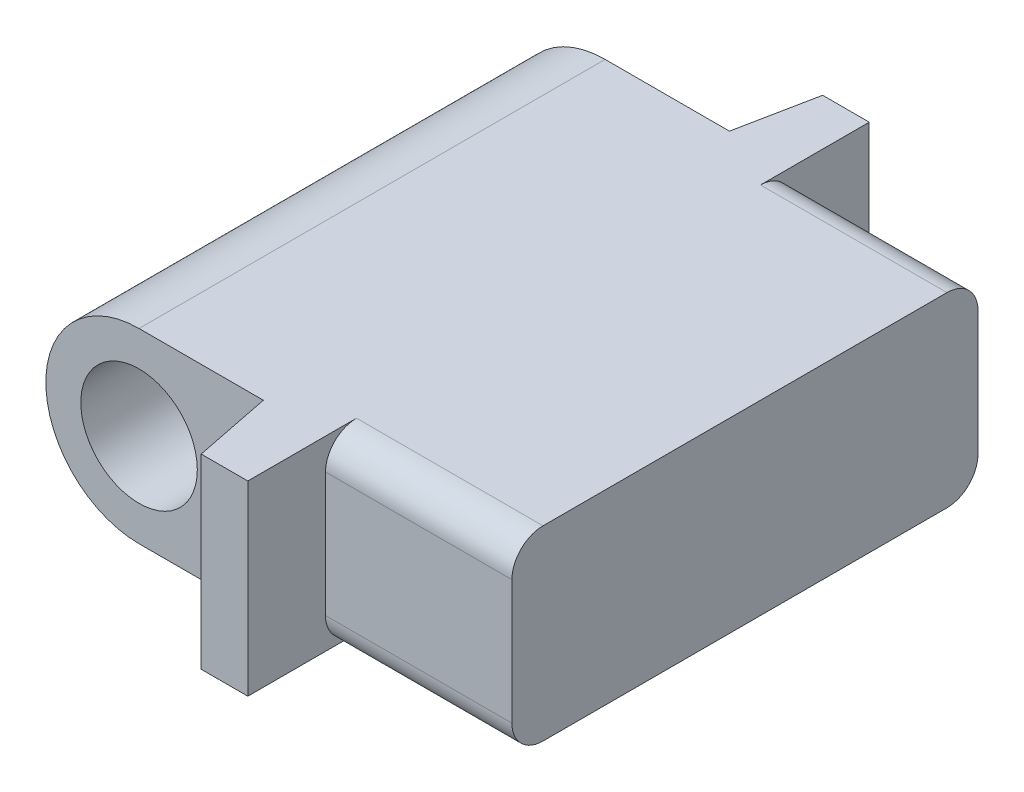
ISO-10303-21;
HEADER;
FILE_DESCRIPTION(('STEP AP214'),'2;1');
FILE_NAME('part.step','',(''),(''),'','','');
FILE_SCHEMA(('AUTOMOTIVE_DESIGN { 1 0 10303 214 1 1 1 1 }'));
ENDSEC;
DATA;
#1=APPLICATION_CONTEXT('core data for automotive mechanical design processes');
#2=APPLICATION_PROTOCOL_DEFINITION('international standard','automotive_design',2000,#1);
#3=PRODUCT_CONTEXT('',#1,'mechanical');
#4=PRODUCT('Part','Part','',(#3));
#5=PRODUCT_RELATED_PRODUCT_CATEGORY('part','',(#4));
#6=PRODUCT_DEFINITION_FORMATION('','',#4);
#7=PRODUCT_DEFINITION_CONTEXT('part definition',#1,'design');
#8=PRODUCT_DEFINITION('design','',#6,#7);
#9=PRODUCT_DEFINITION_SHAPE('','',#8);
#10=(LENGTH_UNIT() NAMED_UNIT(*) SI_UNIT(.MILLI.,.METRE.));
#11=(NAMED_UNIT(*) PLANE_ANGLE_UNIT() SI_UNIT($,.RADIAN.));
#12=(NAMED_UNIT(*) SI_UNIT($,.STERADIAN.) SOLID_ANGLE_UNIT());
#13=UNCERTAINTY_MEASURE_WITH_UNIT(LENGTH_MEASURE(1.E-05),#10,'distance_accuracy_value','');
#14=(GEOMETRIC_REPRESENTATION_CONTEXT(3) GLOBAL_UNCERTAINTY_ASSIGNED_CONTEXT((#13)) GLOBAL_UNIT_ASSIGNED_CONTEXT((#10,
#11,#12)) REPRESENTATION_CONTEXT('',''));
#15=CARTESIAN_POINT('',(0.,0.,0.));
#16=DIRECTION('',(0.,0.,1.));
#17=DIRECTION('',(1.,0.,0.));
#18=AXIS2_PLACEMENT_3D('',#15,#16,#17);
#19=CARTESIAN_POINT('',(0.,0.,19.05));
#20=DIRECTION('',(0.,0.,1.));
#21=DIRECTION('',(1.,0.,0.));
#22=AXIS2_PLACEMENT_3D('',#19,#20,#21);
#23=PLANE('',#22);
#24=CARTESIAN_POINT('',(-11.43,7.62,19.05));
#25=DIRECTION('',(0.,0.,1.));
#26=DIRECTION('',(1.,0.,0.));
#27=AXIS2_PLACEMENT_3D('',#24,#25,#26);
#28=CIRCLE('',#27,4.7625);
#29=CARTESIAN_POINT('',(-6.6675,7.62,19.05));
#30=VERTEX_POINT('',#29);
#31=EDGE_CURVE('E261',#30,#30,#28,.T.);
#32=ORIENTED_EDGE('',*,*,#31,.F.);
#33=EDGE_LOOP('',(#32));
#34=FACE_BOUND('',#33,.T.);
#35=CARTESIAN_POINT('',(-11.43,7.62,19.05));
#36=DIRECTION('',(0.,0.,1.));
#37=DIRECTION('',(1.,0.,0.));
#38=AXIS2_PLACEMENT_3D('',#35,#36,#37);
#39=CIRCLE('',#38,7.62);
#40=CARTESIAN_POINT('',(-11.43,15.24,19.05));
#41=VERTEX_POINT('',#40);
#42=CARTESIAN_POINT('',(-11.43,0.,19.05));
#43=VERTEX_POINT('',#42);
#44=EDGE_CURVE('E172',#41,#43,#39,.T.);
#45=ORIENTED_EDGE('',*,*,#44,.T.);
#46=DIRECTION('',(1.,0.,0.));
#47=VECTOR('',#46,1.);
#48=CARTESIAN_POINT('',(0.,0.,19.05));
#49=LINE('',#48,#47);
#50=CARTESIAN_POINT('',(-1.27000000000001,0.,19.05));
#51=VERTEX_POINT('',#50);
#52=EDGE_CURVE('E176',#43,#51,#49,.T.);
#53=ORIENTED_EDGE('',*,*,#52,.T.);
#54=DIRECTION('',(0.,1.,0.));
#55=VECTOR('',#54,1.);
#56=CARTESIAN_POINT('',(-1.27000000000001,0.,19.05));
#57=LINE('',#56,#55);
#58=CARTESIAN_POINT('',(-1.27000000000001,15.24,19.05));
#59=VERTEX_POINT('',#58);
#60=EDGE_CURVE('E209',#51,#59,#57,.T.);
#61=ORIENTED_EDGE('',*,*,#60,.T.);
#62=DIRECTION('',(1.,0.,0.));
#63=VECTOR('',#62,1.);
#64=CARTESIAN_POINT('',(0.,15.24,19.05));
#65=LINE('',#64,#63);
#66=EDGE_CURVE('E178',#41,#59,#65,.T.);
#67=ORIENTED_EDGE('',*,*,#66,.F.);
#68=EDGE_LOOP('',(#45,#53,#61,#67));
#69=FACE_BOUND('',#68,.T.);
#70=ADVANCED_FACE('F60',(#34,#69),#23,.T.);
#71=CARTESIAN_POINT('',(0.,0.,-19.05));
#72=DIRECTION('',(0.,0.,1.));
#73=DIRECTION('',(1.,0.,0.));
#74=AXIS2_PLACEMENT_3D('',#71,#72,#73);
#75=PLANE('',#74);
#76=CARTESIAN_POINT('',(-11.43,7.62,-19.05));
#77=DIRECTION('',(0.,0.,1.));
#78=DIRECTION('',(1.,0.,0.));
#79=AXIS2_PLACEMENT_3D('',#76,#77,#78);
#80=CIRCLE('',#79,4.7625);
#81=CARTESIAN_POINT('',(-6.6675,7.62,-19.05));
#82=VERTEX_POINT('',#81);
#83=EDGE_CURVE('E182',#82,#82,#80,.T.);
#84=ORIENTED_EDGE('',*,*,#83,.T.);
#85=EDGE_LOOP('',(#84));
#86=FACE_BOUND('',#85,.T.);
#87=DIRECTION('',(1.,0.,0.));
#88=VECTOR('',#87,1.);
#89=CARTESIAN_POINT('',(0.,0.,-19.05));
#90=LINE('',#89,#88);
#91=CARTESIAN_POINT('',(-11.43,0.,-19.05));
#92=VERTEX_POINT('',#91);
#93=CARTESIAN_POINT('',(-1.27000000000001,0.,-19.05));
#94=VERTEX_POINT('',#93);
#95=EDGE_CURVE('E213',#92,#94,#90,.T.);
#96=ORIENTED_EDGE('',*,*,#95,.F.);
#97=CARTESIAN_POINT('',(-11.43,7.62,-19.05));
#98=DIRECTION('',(0.,0.,1.));
#99=DIRECTION('',(1.,0.,0.));
#100=AXIS2_PLACEMENT_3D('',#97,#98,#99);
#101=CIRCLE('',#100,7.62);
#102=CARTESIAN_POINT('',(-11.43,15.24,-19.05));
#103=VERTEX_POINT('',#102);
#104=EDGE_CURVE('E188',#103,#92,#101,.T.);
#105=ORIENTED_EDGE('',*,*,#104,.F.);
#106=DIRECTION('',(1.,0.,0.));
#107=VECTOR('',#106,1.);
#108=CARTESIAN_POINT('',(0.,15.24,-19.05));
#109=LINE('',#108,#107);
#110=CARTESIAN_POINT('',(-1.27000000000001,15.24,-19.05));
#111=VERTEX_POINT('',#110);
#112=EDGE_CURVE('E220',#103,#111,#109,.T.);
#113=ORIENTED_EDGE('',*,*,#112,.T.);
#114=DIRECTION('',(0.,1.,0.));
#115=VECTOR('',#114,1.);
#116=CARTESIAN_POINT('',(-1.27000000000001,0.,-19.05));
#117=LINE('',#116,#115);
#118=EDGE_CURVE('E219',#94,#111,#117,.T.);
#119=ORIENTED_EDGE('',*,*,#118,.F.);
#120=EDGE_LOOP('',(#96,#105,#113,#119));
#121=FACE_BOUND('',#120,.T.);
#122=ADVANCED_FACE('F329',(#86,#121),#75,.F.);
#123=CARTESIAN_POINT('',(0.,0.,0.));
#124=DIRECTION('',(0.,1.,0.));
#125=DIRECTION('',(0.,0.,1.));
#126=AXIS2_PLACEMENT_3D('',#123,#124,#125);
#127=PLANE('',#126);
#128=DIRECTION('',(0.,0.,1.));
#129=VECTOR('',#128,1.);
#130=CARTESIAN_POINT('',(3.81,0.,0.));
#131=LINE('',#130,#129);
#132=CARTESIAN_POINT('',(3.80999999999999,0.,-25.4));
#133=VERTEX_POINT('',#132);
#134=CARTESIAN_POINT('',(3.80999999999999,0.,-16.51));
#135=VERTEX_POINT('',#134);
#136=EDGE_CURVE('E227',#133,#135,#131,.T.);
#137=ORIENTED_EDGE('',*,*,#136,.T.);
#138=DIRECTION('',(1.,0.,0.));
#139=VECTOR('',#138,1.);
#140=CARTESIAN_POINT('',(0.,0.,-16.51));
#141=LINE('',#140,#139);
#142=CARTESIAN_POINT('',(19.05,0.,-16.51));
#143=VERTEX_POINT('',#142);
#144=EDGE_CURVE('E283',#135,#143,#141,.T.);
#145=ORIENTED_EDGE('',*,*,#144,.T.);
#146=DIRECTION('',(0.,0.,-1.));
#147=VECTOR('',#146,1.);
#148=CARTESIAN_POINT('',(19.05,0.,25.4));
#149=LINE('',#148,#147);
#150=CARTESIAN_POINT('',(19.05,0.,16.51));
#151=VERTEX_POINT('',#150);
#152=EDGE_CURVE('E253',#151,#143,#149,.T.);
#153=ORIENTED_EDGE('',*,*,#152,.F.);
#154=DIRECTION('',(1.,0.,0.));
#155=VECTOR('',#154,1.);
#156=CARTESIAN_POINT('',(3.80999999999998,0.,16.51));
#157=LINE('',#156,#155);
#158=CARTESIAN_POINT('',(3.80999999999999,0.,16.51));
#159=VERTEX_POINT('',#158);
#160=EDGE_CURVE('E280',#151,#159,#157,.F.);
#161=ORIENTED_EDGE('',*,*,#160,.T.);
#162=DIRECTION('',(0.,0.,-1.));
#163=VECTOR('',#162,1.);
#164=CARTESIAN_POINT('',(3.80999999999999,0.,0.));
#165=LINE('',#164,#163);
#166=CARTESIAN_POINT('',(3.80999999999999,0.,25.4));
#167=VERTEX_POINT('',#166);
#168=EDGE_CURVE('E319',#167,#159,#165,.T.);
#169=ORIENTED_EDGE('',*,*,#168,.F.);
#170=DIRECTION('',(1.,0.,0.));
#171=VECTOR('',#170,1.);
#172=CARTESIAN_POINT('',(19.05,0.,25.4));
#173=LINE('',#172,#171);
#174=CARTESIAN_POINT('',(0.,0.,25.4));
#175=VERTEX_POINT('',#174);
#176=EDGE_CURVE('E235',#175,#167,#173,.T.);
#177=ORIENTED_EDGE('',*,*,#176,.F.);
#178=DIRECTION('',(0.196116135138184,0.,0.98058067569092));
#179=VECTOR('',#178,1.);
#180=CARTESIAN_POINT('',(-4.8846153846154,0.,0.97692307692308));
#181=LINE('',#180,#179);
#182=EDGE_CURVE('E196',#51,#175,#181,.T.);
#183=ORIENTED_EDGE('',*,*,#182,.F.);
#184=ORIENTED_EDGE('',*,*,#52,.F.);
#185=DIRECTION('',(0.,0.,1.));
#186=VECTOR('',#185,1.);
#187=CARTESIAN_POINT('',(-11.43,0.,-25.4));
#188=LINE('',#187,#186);
#189=EDGE_CURVE('E185',#92,#43,#188,.T.);
#190=ORIENTED_EDGE('',*,*,#189,.F.);
#191=ORIENTED_EDGE('',*,*,#95,.T.);
#192=DIRECTION('',(0.196116135138184,0.,-0.98058067569092));
#193=VECTOR('',#192,1.);
#194=CARTESIAN_POINT('',(-4.88461538461539,0.,-0.976923076923078));
#195=LINE('',#194,#193);
#196=CARTESIAN_POINT('',(0.,0.,-25.4));
#197=VERTEX_POINT('',#196);
#198=EDGE_CURVE('E215',#94,#197,#195,.T.);
#199=ORIENTED_EDGE('',*,*,#198,.T.);
#200=DIRECTION('',(-1.,0.,0.));
#201=VECTOR('',#200,1.);
#202=CARTESIAN_POINT('',(19.05,0.,-25.4));
#203=LINE('',#202,#201);
#204=EDGE_CURVE('E245',#133,#197,#203,.T.);
#205=ORIENTED_EDGE('',*,*,#204,.F.);
#206=EDGE_LOOP('',(#137,#145,#153,#161,#169,#177,#183,#184,#190,#191,#199,#205));
#207=FACE_BOUND('',#206,.T.);
#208=ADVANCED_FACE('F194',(#207),#127,.F.);
#209=CARTESIAN_POINT('',(0.,15.24,0.));
#210=DIRECTION('',(0.,1.,0.));
#211=DIRECTION('',(0.,0.,1.));
#212=AXIS2_PLACEMENT_3D('',#209,#210,#211);
#213=PLANE('',#212);
#214=DIRECTION('',(0.,0.,-1.));
#215=VECTOR('',#214,1.);
#216=CARTESIAN_POINT('',(19.05,15.24,25.4));
#217=LINE('',#216,#215);
#218=CARTESIAN_POINT('',(19.05,15.24,16.51));
#219=VERTEX_POINT('',#218);
#220=CARTESIAN_POINT('',(19.05,15.24,-16.51));
#221=VERTEX_POINT('',#220);
#222=EDGE_CURVE('E244',#219,#221,#217,.T.);
#223=ORIENTED_EDGE('',*,*,#222,.T.);
#224=DIRECTION('',(1.,0.,0.));
#225=VECTOR('',#224,1.);
#226=CARTESIAN_POINT('',(3.80999999999999,15.24,-16.51));
#227=LINE('',#226,#225);
#228=CARTESIAN_POINT('',(3.80999999999999,15.24,-16.51));
#229=VERTEX_POINT('',#228);
#230=EDGE_CURVE('E277',#221,#229,#227,.F.);
#231=ORIENTED_EDGE('',*,*,#230,.T.);
#232=DIRECTION('',(0.,0.,1.));
#233=VECTOR('',#232,1.);
#234=CARTESIAN_POINT('',(3.81,15.24,0.));
#235=LINE('',#234,#233);
#236=CARTESIAN_POINT('',(3.80999999999999,15.24,-25.4));
#237=VERTEX_POINT('',#236);
#238=EDGE_CURVE('E230',#237,#229,#235,.T.);
#239=ORIENTED_EDGE('',*,*,#238,.F.);
#240=DIRECTION('',(-1.,0.,0.));
#241=VECTOR('',#240,1.);
#242=CARTESIAN_POINT('',(19.05,15.24,-25.4));
#243=LINE('',#242,#241);
#244=CARTESIAN_POINT('',(0.,15.24,-25.4));
#245=VERTEX_POINT('',#244);
#246=EDGE_CURVE('E248',#237,#245,#243,.T.);
#247=ORIENTED_EDGE('',*,*,#246,.T.);
#248=DIRECTION('',(0.196116135138184,0.,-0.98058067569092));
#249=VECTOR('',#248,1.);
#250=CARTESIAN_POINT('',(-4.88461538461539,15.24,-0.976923076923078));
#251=LINE('',#250,#249);
#252=EDGE_CURVE('E216',#111,#245,#251,.T.);
#253=ORIENTED_EDGE('',*,*,#252,.F.);
#254=ORIENTED_EDGE('',*,*,#112,.F.);
#255=DIRECTION('',(0.,0.,1.));
#256=VECTOR('',#255,1.);
#257=CARTESIAN_POINT('',(-11.43,15.24,-25.4));
#258=LINE('',#257,#256);
#259=EDGE_CURVE('E181',#103,#41,#258,.T.);
#260=ORIENTED_EDGE('',*,*,#259,.T.);
#261=ORIENTED_EDGE('',*,*,#66,.T.);
#262=DIRECTION('',(0.196116135138184,0.,0.98058067569092));
#263=VECTOR('',#262,1.);
#264=CARTESIAN_POINT('',(-4.8846153846154,15.24,0.97692307692308));
#265=LINE('',#264,#263);
#266=CARTESIAN_POINT('',(0.,15.24,25.4));
#267=VERTEX_POINT('',#266);
#268=EDGE_CURVE('E197',#59,#267,#265,.T.);
#269=ORIENTED_EDGE('',*,*,#268,.T.);
#270=DIRECTION('',(1.,0.,0.));
#271=VECTOR('',#270,1.);
#272=CARTESIAN_POINT('',(19.05,15.24,25.4));
#273=LINE('',#272,#271);
#274=CARTESIAN_POINT('',(3.80999999999999,15.24,25.4));
#275=VERTEX_POINT('',#274);
#276=EDGE_CURVE('E241',#267,#275,#273,.T.);
#277=ORIENTED_EDGE('',*,*,#276,.T.);
#278=DIRECTION('',(0.,0.,-1.));
#279=VECTOR('',#278,1.);
#280=CARTESIAN_POINT('',(3.80999999999999,15.24,0.));
#281=LINE('',#280,#279);
#282=CARTESIAN_POINT('',(3.80999999999999,15.24,16.51));
#283=VERTEX_POINT('',#282);
#284=EDGE_CURVE('E211',#275,#283,#281,.T.);
#285=ORIENTED_EDGE('',*,*,#284,.T.);
#286=DIRECTION('',(1.,0.,0.));
#287=VECTOR('',#286,1.);
#288=CARTESIAN_POINT('',(0.,15.24,16.51));
#289=LINE('',#288,#287);
#290=EDGE_CURVE('E274',#283,#219,#289,.T.);
#291=ORIENTED_EDGE('',*,*,#290,.T.);
#292=EDGE_LOOP('',(#223,#231,#239,#247,#253,#254,#260,#261,#269,#277,#285,#291));
#293=FACE_BOUND('',#292,.T.);
#294=ADVANCED_FACE('F352',(#293),#213,.T.);
#295=CARTESIAN_POINT('',(19.05,15.24,25.4));
#296=DIRECTION('',(0.,0.,-1.));
#297=DIRECTION('',(-1.,0.,0.));
#298=AXIS2_PLACEMENT_3D('',#295,#296,#297);
#299=PLANE('',#298);
#300=DIRECTION('',(0.,1.,0.));
#301=VECTOR('',#300,1.);
#302=CARTESIAN_POINT('',(0.,0.,25.4));
#303=LINE('',#302,#301);
#304=EDGE_CURVE('E199',#175,#267,#303,.T.);
#305=ORIENTED_EDGE('',*,*,#304,.F.);
#306=ORIENTED_EDGE('',*,*,#176,.T.);
#307=DIRECTION('',(0.,1.,0.));
#308=VECTOR('',#307,1.);
#309=CARTESIAN_POINT('',(3.80999999999999,0.,25.4));
#310=LINE('',#309,#308);
#311=EDGE_CURVE('E204',#167,#275,#310,.T.);
#312=ORIENTED_EDGE('',*,*,#311,.T.);
#313=ORIENTED_EDGE('',*,*,#276,.F.);
#314=EDGE_LOOP('',(#305,#306,#312,#313));
#315=FACE_BOUND('',#314,.T.);
#316=ADVANCED_FACE('F355',(#315),#299,.F.);
#317=CARTESIAN_POINT('',(19.05,15.24,25.4));
#318=DIRECTION('',(-1.,0.,0.));
#319=DIRECTION('',(0.,0.,1.));
#320=AXIS2_PLACEMENT_3D('',#317,#318,#319);
#321=PLANE('',#320);
#322=DIRECTION('',(0.,1.,0.));
#323=VECTOR('',#322,1.);
#324=CARTESIAN_POINT('',(19.05,0.,-19.05));
#325=LINE('',#324,#323);
#326=CARTESIAN_POINT('',(19.05,2.54,-19.05));
#327=VERTEX_POINT('',#326);
#328=CARTESIAN_POINT('',(19.05,12.7,-19.05));
#329=VERTEX_POINT('',#328);
#330=EDGE_CURVE('E236',#327,#329,#325,.T.);
#331=ORIENTED_EDGE('',*,*,#330,.T.);
#332=CARTESIAN_POINT('',(19.05,12.7,-16.51));
#333=DIRECTION('',(-1.,0.,0.));
#334=DIRECTION('',(0.,0.,1.));
#335=AXIS2_PLACEMENT_3D('',#332,#333,#334);
#336=CIRCLE('',#335,2.54);
#337=EDGE_CURVE('E272',#329,#221,#336,.F.);
#338=ORIENTED_EDGE('',*,*,#337,.T.);
#339=ORIENTED_EDGE('',*,*,#222,.F.);
#340=CARTESIAN_POINT('',(19.05,12.7,16.51));
#341=DIRECTION('',(-1.,0.,0.));
#342=DIRECTION('',(0.,0.,1.));
#343=AXIS2_PLACEMENT_3D('',#340,#341,#342);
#344=CIRCLE('',#343,2.54);
#345=CARTESIAN_POINT('',(19.05,12.7,19.05));
#346=VERTEX_POINT('',#345);
#347=EDGE_CURVE('E266',#219,#346,#344,.F.);
#348=ORIENTED_EDGE('',*,*,#347,.T.);
#349=DIRECTION('',(0.,1.,0.));
#350=VECTOR('',#349,1.);
#351=CARTESIAN_POINT('',(19.05,0.,19.05));
#352=LINE('',#351,#350);
#353=CARTESIAN_POINT('',(19.05,2.54,19.05));
#354=VERTEX_POINT('',#353);
#355=EDGE_CURVE('E310',#354,#346,#352,.T.);
#356=ORIENTED_EDGE('',*,*,#355,.F.);
#357=CARTESIAN_POINT('',(19.05,2.54,16.51));
#358=DIRECTION('',(-1.,0.,0.));
#359=DIRECTION('',(0.,0.,1.));
#360=AXIS2_PLACEMENT_3D('',#357,#358,#359);
#361=CIRCLE('',#360,2.54);
#362=EDGE_CURVE('E268',#354,#151,#361,.F.);
#363=ORIENTED_EDGE('',*,*,#362,.T.);
#364=ORIENTED_EDGE('',*,*,#152,.T.);
#365=CARTESIAN_POINT('',(19.05,2.54,-16.51));
#366=DIRECTION('',(-1.,0.,0.));
#367=DIRECTION('',(0.,0.,1.));
#368=AXIS2_PLACEMENT_3D('',#365,#366,#367);
#369=CIRCLE('',#368,2.54);
#370=EDGE_CURVE('E270',#143,#327,#369,.F.);
#371=ORIENTED_EDGE('',*,*,#370,.T.);
#372=EDGE_LOOP('',(#331,#338,#339,#348,#356,#363,#364,#371));
#373=FACE_BOUND('',#372,.T.);
#374=ADVANCED_FACE('F307',(#373),#321,.F.);
#375=CARTESIAN_POINT('',(19.05,15.24,-25.4));
#376=DIRECTION('',(0.,0.,1.));
#377=DIRECTION('',(1.,0.,0.));
#378=AXIS2_PLACEMENT_3D('',#375,#376,#377);
#379=PLANE('',#378);
#380=ORIENTED_EDGE('',*,*,#204,.T.);
#381=DIRECTION('',(0.,1.,0.));
#382=VECTOR('',#381,1.);
#383=CARTESIAN_POINT('',(0.,0.,-25.4));
#384=LINE('',#383,#382);
#385=EDGE_CURVE('E207',#197,#245,#384,.T.);
#386=ORIENTED_EDGE('',*,*,#385,.T.);
#387=ORIENTED_EDGE('',*,*,#246,.F.);
#388=DIRECTION('',(0.,1.,0.));
#389=VECTOR('',#388,1.);
#390=CARTESIAN_POINT('',(3.80999999999999,0.,-25.4));
#391=LINE('',#390,#389);
#392=EDGE_CURVE('E233',#133,#237,#391,.T.);
#393=ORIENTED_EDGE('',*,*,#392,.F.);
#394=EDGE_LOOP('',(#380,#386,#387,#393));
#395=FACE_BOUND('',#394,.T.);
#396=ADVANCED_FACE('F351',(#395),#379,.F.);
#397=CARTESIAN_POINT('',(3.81,0.,0.));
#398=DIRECTION('',(-1.,0.,0.));
#399=DIRECTION('',(0.,0.,1.));
#400=AXIS2_PLACEMENT_3D('',#397,#398,#399);
#401=PLANE('',#400);
#402=ORIENTED_EDGE('',*,*,#238,.T.);
#403=CARTESIAN_POINT('',(3.80999999999999,12.7,-16.51));
#404=DIRECTION('',(-1.,0.,0.));
#405=DIRECTION('',(0.,0.,1.));
#406=AXIS2_PLACEMENT_3D('',#403,#404,#405);
#407=CIRCLE('',#406,2.54);
#408=CARTESIAN_POINT('',(3.80999999999999,12.7,-19.05));
#409=VERTEX_POINT('',#408);
#410=EDGE_CURVE('E290',#229,#409,#407,.T.);
#411=ORIENTED_EDGE('',*,*,#410,.T.);
#412=DIRECTION('',(0.,1.,0.));
#413=VECTOR('',#412,1.);
#414=CARTESIAN_POINT('',(3.80999999999999,0.,-19.05));
#415=LINE('',#414,#413);
#416=CARTESIAN_POINT('',(3.80999999999999,2.54,-19.05));
#417=VERTEX_POINT('',#416);
#418=EDGE_CURVE('E229',#417,#409,#415,.T.);
#419=ORIENTED_EDGE('',*,*,#418,.F.);
#420=CARTESIAN_POINT('',(3.80999999999999,2.54,-16.51));
#421=DIRECTION('',(-1.,0.,0.));
#422=DIRECTION('',(0.,0.,1.));
#423=AXIS2_PLACEMENT_3D('',#420,#421,#422);
#424=CIRCLE('',#423,2.54);
#425=EDGE_CURVE('E292',#417,#135,#424,.T.);
#426=ORIENTED_EDGE('',*,*,#425,.T.);
#427=ORIENTED_EDGE('',*,*,#136,.F.);
#428=ORIENTED_EDGE('',*,*,#392,.T.);
#429=EDGE_LOOP('',(#402,#411,#419,#426,#427,#428));
#430=FACE_BOUND('',#429,.T.);
#431=ADVANCED_FACE('F298',(#430),#401,.F.);
#432=CARTESIAN_POINT('',(0.,0.,-19.05));
#433=DIRECTION('',(0.,0.,1.));
#434=DIRECTION('',(1.,0.,0.));
#435=AXIS2_PLACEMENT_3D('',#432,#433,#434);
#436=PLANE('',#435);
#437=ORIENTED_EDGE('',*,*,#418,.T.);
#438=DIRECTION('',(1.,0.,0.));
#439=VECTOR('',#438,1.);
#440=CARTESIAN_POINT('',(19.05,12.7,-19.05));
#441=LINE('',#440,#439);
#442=EDGE_CURVE('E263',#409,#329,#441,.T.);
#443=ORIENTED_EDGE('',*,*,#442,.T.);
#444=ORIENTED_EDGE('',*,*,#330,.F.);
#445=DIRECTION('',(1.,0.,0.));
#446=VECTOR('',#445,1.);
#447=CARTESIAN_POINT('',(0.,2.54,-19.05));
#448=LINE('',#447,#446);
#449=EDGE_CURVE('E191',#327,#417,#448,.F.);
#450=ORIENTED_EDGE('',*,*,#449,.T.);
#451=EDGE_LOOP('',(#437,#443,#444,#450));
#452=FACE_BOUND('',#451,.T.);
#453=ADVANCED_FACE('F344',(#452),#436,.F.);
#454=CARTESIAN_POINT('',(3.80999999999999,0.,0.));
#455=DIRECTION('',(1.,0.,0.));
#456=DIRECTION('',(0.,0.,-1.));
#457=AXIS2_PLACEMENT_3D('',#454,#455,#456);
#458=PLANE('',#457);
#459=ORIENTED_EDGE('',*,*,#284,.F.);
#460=ORIENTED_EDGE('',*,*,#311,.F.);
#461=ORIENTED_EDGE('',*,*,#168,.T.);
#462=CARTESIAN_POINT('',(3.80999999999999,2.54,16.51));
#463=DIRECTION('',(1.,0.,0.));
#464=DIRECTION('',(0.,0.,-1.));
#465=AXIS2_PLACEMENT_3D('',#462,#463,#464);
#466=CIRCLE('',#465,2.54);
#467=CARTESIAN_POINT('',(3.80999999999999,2.54,19.05));
#468=VERTEX_POINT('',#467);
#469=EDGE_CURVE('E68',#159,#468,#466,.F.);
#470=ORIENTED_EDGE('',*,*,#469,.T.);
#471=DIRECTION('',(0.,1.,0.));
#472=VECTOR('',#471,1.);
#473=CARTESIAN_POINT('',(3.80999999999999,0.,19.05));
#474=LINE('',#473,#472);
#475=CARTESIAN_POINT('',(3.80999999999999,12.7,19.05));
#476=VERTEX_POINT('',#475);
#477=EDGE_CURVE('E232',#468,#476,#474,.T.);
#478=ORIENTED_EDGE('',*,*,#477,.T.);
#479=CARTESIAN_POINT('',(3.80999999999999,12.7,16.51));
#480=DIRECTION('',(1.,0.,0.));
#481=DIRECTION('',(0.,0.,-1.));
#482=AXIS2_PLACEMENT_3D('',#479,#480,#481);
#483=CIRCLE('',#482,2.54);
#484=EDGE_CURVE('E12',#476,#283,#483,.F.);
#485=ORIENTED_EDGE('',*,*,#484,.T.);
#486=EDGE_LOOP('',(#459,#460,#461,#470,#478,#485));
#487=FACE_BOUND('',#486,.T.);
#488=ADVANCED_FACE('F347',(#487),#458,.T.);
#489=CARTESIAN_POINT('',(0.,0.,19.05));
#490=DIRECTION('',(0.,0.,1.));
#491=DIRECTION('',(1.,0.,0.));
#492=AXIS2_PLACEMENT_3D('',#489,#490,#491);
#493=PLANE('',#492);
#494=ORIENTED_EDGE('',*,*,#477,.F.);
#495=DIRECTION('',(1.,0.,0.));
#496=VECTOR('',#495,1.);
#497=CARTESIAN_POINT('',(19.05,2.54,19.05));
#498=LINE('',#497,#496);
#499=EDGE_CURVE('E287',#468,#354,#498,.T.);
#500=ORIENTED_EDGE('',*,*,#499,.T.);
#501=ORIENTED_EDGE('',*,*,#355,.T.);
#502=DIRECTION('',(1.,0.,0.));
#503=VECTOR('',#502,1.);
#504=CARTESIAN_POINT('',(0.,12.7,19.05));
#505=LINE('',#504,#503);
#506=EDGE_CURVE('E75',#346,#476,#505,.F.);
#507=ORIENTED_EDGE('',*,*,#506,.T.);
#508=EDGE_LOOP('',(#494,#500,#501,#507));
#509=FACE_BOUND('',#508,.T.);
#510=ADVANCED_FACE('F314',(#509),#493,.T.);
#511=CARTESIAN_POINT('',(-4.8846153846154,0.,0.97692307692308));
#512=DIRECTION('',(-0.98058067569092,0.,0.196116135138184));
#513=DIRECTION('',(0.196116135138184,0.,0.98058067569092));
#514=AXIS2_PLACEMENT_3D('',#511,#512,#513);
#515=PLANE('',#514);
#516=ORIENTED_EDGE('',*,*,#268,.F.);
#517=ORIENTED_EDGE('',*,*,#60,.F.);
#518=ORIENTED_EDGE('',*,*,#182,.T.);
#519=ORIENTED_EDGE('',*,*,#304,.T.);
#520=EDGE_LOOP('',(#516,#517,#518,#519));
#521=FACE_BOUND('',#520,.T.);
#522=ADVANCED_FACE('F338',(#521),#515,.T.);
#523=CARTESIAN_POINT('',(-4.88461538461539,0.,-0.976923076923078));
#524=DIRECTION('',(0.98058067569092,0.,0.196116135138184));
#525=DIRECTION('',(0.196116135138184,0.,-0.98058067569092));
#526=AXIS2_PLACEMENT_3D('',#523,#524,#525);
#527=PLANE('',#526);
#528=ORIENTED_EDGE('',*,*,#252,.T.);
#529=ORIENTED_EDGE('',*,*,#385,.F.);
#530=ORIENTED_EDGE('',*,*,#198,.F.);
#531=ORIENTED_EDGE('',*,*,#118,.T.);
#532=EDGE_LOOP('',(#528,#529,#530,#531));
#533=FACE_BOUND('',#532,.T.);
#534=ADVANCED_FACE('F340',(#533),#527,.F.);
#535=CARTESIAN_POINT('',(-11.43,7.62,-25.4));
#536=DIRECTION('',(0.,0.,1.));
#537=DIRECTION('',(1.,0.,0.));
#538=AXIS2_PLACEMENT_3D('',#535,#536,#537);
#539=CYLINDRICAL_SURFACE('',#538,7.62);
#540=ORIENTED_EDGE('',*,*,#104,.T.);
#541=ORIENTED_EDGE('',*,*,#189,.T.);
#542=ORIENTED_EDGE('',*,*,#44,.F.);
#543=ORIENTED_EDGE('',*,*,#259,.F.);
#544=EDGE_LOOP('',(#540,#541,#542,#543));
#545=FACE_BOUND('',#544,.T.);
#546=ADVANCED_FACE('F186',(#545),#539,.T.);
#547=CARTESIAN_POINT('',(-11.43,7.62,-25.4));
#548=DIRECTION('',(0.,0.,1.));
#549=DIRECTION('',(1.,0.,0.));
#550=AXIS2_PLACEMENT_3D('',#547,#548,#549);
#551=CYLINDRICAL_SURFACE('',#550,4.7625);
#552=ORIENTED_EDGE('',*,*,#31,.T.);
#553=EDGE_LOOP('',(#552));
#554=FACE_BOUND('',#553,.T.);
#555=ORIENTED_EDGE('',*,*,#83,.F.);
#556=EDGE_LOOP('',(#555));
#557=FACE_BOUND('',#556,.T.);
#558=ADVANCED_FACE('F325',(#554,#557),#551,.F.);
#559=CARTESIAN_POINT('',(0.,12.7,-16.51));
#560=DIRECTION('',(-1.,0.,0.));
#561=DIRECTION('',(0.,0.,1.));
#562=AXIS2_PLACEMENT_3D('',#559,#560,#561);
#563=CYLINDRICAL_SURFACE('',#562,2.54);
#564=ORIENTED_EDGE('',*,*,#410,.F.);
#565=ORIENTED_EDGE('',*,*,#230,.F.);
#566=ORIENTED_EDGE('',*,*,#337,.F.);
#567=ORIENTED_EDGE('',*,*,#442,.F.);
#568=EDGE_LOOP('',(#564,#565,#566,#567));
#569=FACE_BOUND('',#568,.T.);
#570=ADVANCED_FACE('F367',(#569),#563,.T.);
#571=CARTESIAN_POINT('',(0.,2.54,-16.51));
#572=DIRECTION('',(1.,0.,0.));
#573=DIRECTION('',(0.,0.,-1.));
#574=AXIS2_PLACEMENT_3D('',#571,#572,#573);
#575=CYLINDRICAL_SURFACE('',#574,2.54);
#576=ORIENTED_EDGE('',*,*,#425,.F.);
#577=ORIENTED_EDGE('',*,*,#449,.F.);
#578=ORIENTED_EDGE('',*,*,#370,.F.);
#579=ORIENTED_EDGE('',*,*,#144,.F.);
#580=EDGE_LOOP('',(#576,#577,#578,#579));
#581=FACE_BOUND('',#580,.T.);
#582=ADVANCED_FACE('F302',(#581),#575,.T.);
#583=CARTESIAN_POINT('',(0.,2.54,16.51));
#584=DIRECTION('',(-1.,0.,0.));
#585=DIRECTION('',(0.,0.,1.));
#586=AXIS2_PLACEMENT_3D('',#583,#584,#585);
#587=CYLINDRICAL_SURFACE('',#586,2.54);
#588=ORIENTED_EDGE('',*,*,#469,.F.);
#589=ORIENTED_EDGE('',*,*,#160,.F.);
#590=ORIENTED_EDGE('',*,*,#362,.F.);
#591=ORIENTED_EDGE('',*,*,#499,.F.);
#592=EDGE_LOOP('',(#588,#589,#590,#591));
#593=FACE_BOUND('',#592,.T.);
#594=ADVANCED_FACE('F313',(#593),#587,.T.);
#595=CARTESIAN_POINT('',(0.,12.7,16.51));
#596=DIRECTION('',(1.,0.,0.));
#597=DIRECTION('',(0.,0.,-1.));
#598=AXIS2_PLACEMENT_3D('',#595,#596,#597);
#599=CYLINDRICAL_SURFACE('',#598,2.54);
#600=ORIENTED_EDGE('',*,*,#484,.F.);
#601=ORIENTED_EDGE('',*,*,#506,.F.);
#602=ORIENTED_EDGE('',*,*,#347,.F.);
#603=ORIENTED_EDGE('',*,*,#290,.F.);
#604=EDGE_LOOP('',(#600,#601,#602,#603));
#605=FACE_BOUND('',#604,.T.);
#606=ADVANCED_FACE('F62',(#605),#599,.T.);
#607=CLOSED_SHELL('',(#70,#122,#208,#294,#316,#374,#396,#431,#453,#488,#510,#522,#534,#546,#558,
#570,#582,#594,#606));
#608=MANIFOLD_SOLID_BREP('B2',#607);
#609=ADVANCED_BREP_SHAPE_REPRESENTATION('',(#18,#608),#14);
#610=SHAPE_DEFINITION_REPRESENTATION(#9,#609);
ENDSEC;
END-ISO-10303-21;
